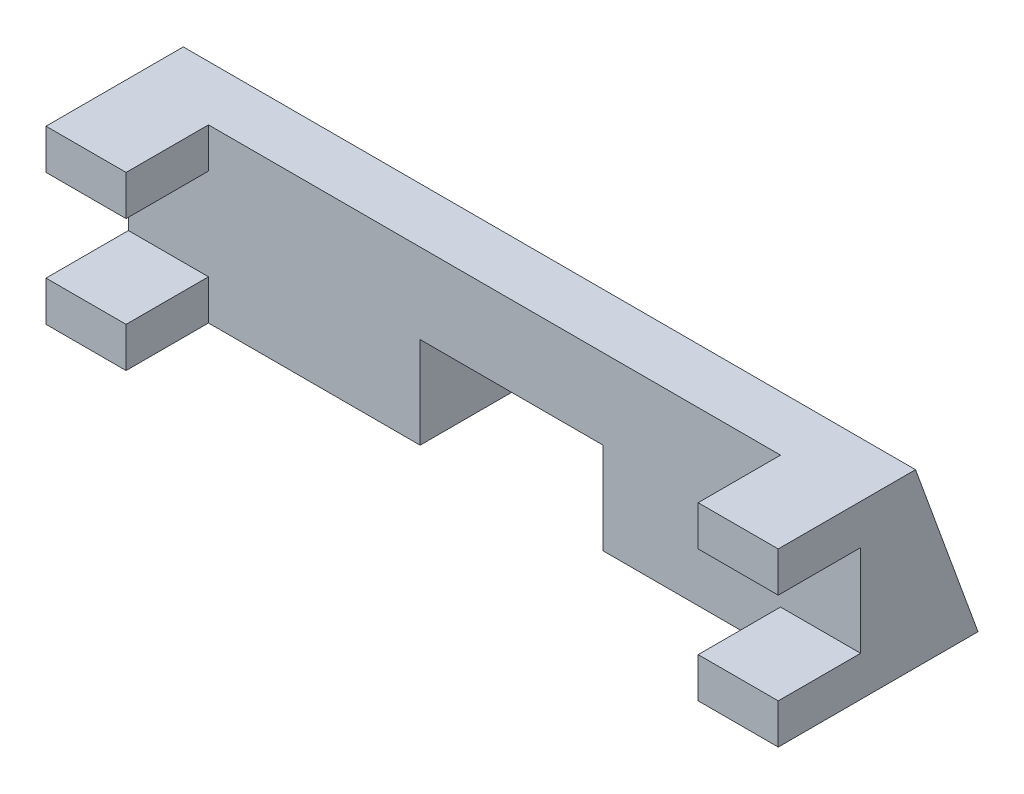
ISO-10303-21;
HEADER;
FILE_DESCRIPTION(('STEP AP214'),'2;1');
FILE_NAME('part.step','',(''),(''),'','','');
FILE_SCHEMA(('AUTOMOTIVE_DESIGN { 1 0 10303 214 1 1 1 1 }'));
ENDSEC;
DATA;
#1=APPLICATION_CONTEXT('core data for automotive mechanical design processes');
#2=APPLICATION_PROTOCOL_DEFINITION('international standard','automotive_design',2000,#1);
#3=PRODUCT_CONTEXT('',#1,'mechanical');
#4=PRODUCT('Part','Part','',(#3));
#5=PRODUCT_RELATED_PRODUCT_CATEGORY('part','',(#4));
#6=PRODUCT_DEFINITION_FORMATION('','',#4);
#7=PRODUCT_DEFINITION_CONTEXT('part definition',#1,'design');
#8=PRODUCT_DEFINITION('design','',#6,#7);
#9=PRODUCT_DEFINITION_SHAPE('','',#8);
#10=(LENGTH_UNIT() NAMED_UNIT(*) SI_UNIT(.MILLI.,.METRE.));
#11=(NAMED_UNIT(*) PLANE_ANGLE_UNIT() SI_UNIT($,.RADIAN.));
#12=(NAMED_UNIT(*) SI_UNIT($,.STERADIAN.) SOLID_ANGLE_UNIT());
#13=UNCERTAINTY_MEASURE_WITH_UNIT(LENGTH_MEASURE(1.E-05),#10,'distance_accuracy_value','');
#14=(GEOMETRIC_REPRESENTATION_CONTEXT(3) GLOBAL_UNCERTAINTY_ASSIGNED_CONTEXT((#13)) GLOBAL_UNIT_ASSIGNED_CONTEXT((#10,
#11,#12)) REPRESENTATION_CONTEXT('',''));
#15=CARTESIAN_POINT('',(0.,0.,0.));
#16=DIRECTION('',(0.,0.,1.));
#17=DIRECTION('',(1.,0.,0.));
#18=AXIS2_PLACEMENT_3D('',#15,#16,#17);
#19=CARTESIAN_POINT('',(64.,-14.8171344824525,-12.3591769522449));
#20=DIRECTION('',(0.,1.,0.));
#21=DIRECTION('',(0.,0.,1.));
#22=AXIS2_PLACEMENT_3D('',#19,#20,#21);
#23=PLANE('',#22);
#24=DIRECTION('',(-1.,0.,0.));
#25=VECTOR('',#24,1.);
#26=CARTESIAN_POINT('',(64.,-14.8171344824525,-17.8187304662379));
#27=LINE('',#26,#25);
#28=CARTESIAN_POINT('',(25.5,-14.8171344824525,-17.8187304662379));
#29=VERTEX_POINT('',#28);
#30=CARTESIAN_POINT('',(0.,-14.8171344824525,-17.8187304662379));
#31=VERTEX_POINT('',#30);
#32=EDGE_CURVE('E187',#29,#31,#27,.T.);
#33=ORIENTED_EDGE('',*,*,#32,.F.);
#34=DIRECTION('',(0.,0.,1.));
#35=VECTOR('',#34,1.);
#36=CARTESIAN_POINT('',(25.5,-14.8171344824525,-12.3591769522449));
#37=LINE('',#36,#35);
#38=CARTESIAN_POINT('',(25.5,-14.8171344824525,-7.55917695224487));
#39=VERTEX_POINT('',#38);
#40=EDGE_CURVE('E11',#29,#39,#37,.T.);
#41=ORIENTED_EDGE('',*,*,#40,.T.);
#42=DIRECTION('',(-1.,0.,0.));
#43=VECTOR('',#42,1.);
#44=CARTESIAN_POINT('',(7.,-14.8171344824525,-7.55917695224487));
#45=LINE('',#44,#43);
#46=CARTESIAN_POINT('',(7.,-14.8171344824525,-7.55917695224487));
#47=VERTEX_POINT('',#46);
#48=EDGE_CURVE('E184',#39,#47,#45,.T.);
#49=ORIENTED_EDGE('',*,*,#48,.T.);
#50=DIRECTION('',(0.,0.,1.));
#51=VECTOR('',#50,1.);
#52=CARTESIAN_POINT('',(7.,-14.8171344824525,-7.55917695224487));
#53=LINE('',#52,#51);
#54=CARTESIAN_POINT('',(7.,-14.8171344824525,-0.359176952244866));
#55=VERTEX_POINT('',#54);
#56=EDGE_CURVE('E198',#47,#55,#53,.T.);
#57=ORIENTED_EDGE('',*,*,#56,.T.);
#58=DIRECTION('',(-1.,0.,0.));
#59=VECTOR('',#58,1.);
#60=CARTESIAN_POINT('',(64.,-14.8171344824525,-0.359176952244866));
#61=LINE('',#60,#59);
#62=CARTESIAN_POINT('',(0.,-14.8171344824525,-0.359176952244866));
#63=VERTEX_POINT('',#62);
#64=EDGE_CURVE('E244',#55,#63,#61,.T.);
#65=ORIENTED_EDGE('',*,*,#64,.T.);
#66=DIRECTION('',(0.,0.,-1.));
#67=VECTOR('',#66,1.);
#68=CARTESIAN_POINT('',(0.,-14.8171344824525,-12.3591769522449));
#69=LINE('',#68,#67);
#70=EDGE_CURVE('E229',#63,#31,#69,.T.);
#71=ORIENTED_EDGE('',*,*,#70,.T.);
#72=EDGE_LOOP('',(#33,#41,#49,#57,#65,#71));
#73=FACE_BOUND('',#72,.T.);
#74=ADVANCED_FACE('F33',(#73),#23,.F.);
#75=CARTESIAN_POINT('',(64.,-3.31713448245253,-0.359176952244866));
#76=DIRECTION('',(0.,0.,-1.));
#77=DIRECTION('',(-1.,0.,0.));
#78=AXIS2_PLACEMENT_3D('',#75,#76,#77);
#79=PLANE('',#78);
#80=DIRECTION('',(-1.,0.,0.));
#81=VECTOR('',#80,1.);
#82=CARTESIAN_POINT('',(64.,-3.31713448245253,-0.359176952244866));
#83=LINE('',#82,#81);
#84=CARTESIAN_POINT('',(7.,-3.31713448245253,-0.359176952244866));
#85=VERTEX_POINT('',#84);
#86=CARTESIAN_POINT('',(0.,-3.31713448245253,-0.359176952244866));
#87=VERTEX_POINT('',#86);
#88=EDGE_CURVE('E280',#85,#87,#83,.T.);
#89=ORIENTED_EDGE('',*,*,#88,.F.);
#90=DIRECTION('',(0.,1.,0.));
#91=VECTOR('',#90,1.);
#92=CARTESIAN_POINT('',(7.,-14.8171344824525,-0.359176952244866));
#93=LINE('',#92,#91);
#94=CARTESIAN_POINT('',(7.,0.182865517547473,-0.359176952244866));
#95=VERTEX_POINT('',#94);
#96=EDGE_CURVE('E196',#85,#95,#93,.T.);
#97=ORIENTED_EDGE('',*,*,#96,.T.);
#98=DIRECTION('',(-1.,0.,0.));
#99=VECTOR('',#98,1.);
#100=CARTESIAN_POINT('',(64.,0.182865517547472,-0.359176952244866));
#101=LINE('',#100,#99);
#102=CARTESIAN_POINT('',(0.,0.182865517547472,-0.359176952244866));
#103=VERTEX_POINT('',#102);
#104=EDGE_CURVE('E284',#95,#103,#101,.T.);
#105=ORIENTED_EDGE('',*,*,#104,.T.);
#106=DIRECTION('',(0.,-1.,0.));
#107=VECTOR('',#106,1.);
#108=CARTESIAN_POINT('',(0.,-3.31713448245253,-0.359176952244866));
#109=LINE('',#108,#107);
#110=EDGE_CURVE('E249',#103,#87,#109,.T.);
#111=ORIENTED_EDGE('',*,*,#110,.T.);
#112=EDGE_LOOP('',(#89,#97,#105,#111));
#113=FACE_BOUND('',#112,.T.);
#114=ADVANCED_FACE('F372',(#113),#79,.F.);
#115=CARTESIAN_POINT('',(64.,-3.31713448245253,-0.359176952244866));
#116=DIRECTION('',(0.,1.,0.));
#117=DIRECTION('',(0.,0.,1.));
#118=AXIS2_PLACEMENT_3D('',#115,#116,#117);
#119=PLANE('',#118);
#120=DIRECTION('',(-1.,0.,0.));
#121=VECTOR('',#120,1.);
#122=CARTESIAN_POINT('',(64.,-3.31713448245253,-7.55917695224487));
#123=LINE('',#122,#121);
#124=CARTESIAN_POINT('',(7.,-3.31713448245253,-7.55917695224487));
#125=VERTEX_POINT('',#124);
#126=CARTESIAN_POINT('',(0.,-3.31713448245253,-7.55917695224487));
#127=VERTEX_POINT('',#126);
#128=EDGE_CURVE('E276',#125,#127,#123,.T.);
#129=ORIENTED_EDGE('',*,*,#128,.F.);
#130=DIRECTION('',(0.,0.,1.));
#131=VECTOR('',#130,1.);
#132=CARTESIAN_POINT('',(7.,-3.31713448245253,-0.359176952244866));
#133=LINE('',#132,#131);
#134=EDGE_CURVE('E221',#125,#85,#133,.T.);
#135=ORIENTED_EDGE('',*,*,#134,.T.);
#136=ORIENTED_EDGE('',*,*,#88,.T.);
#137=DIRECTION('',(0.,0.,-1.));
#138=VECTOR('',#137,1.);
#139=CARTESIAN_POINT('',(0.,-3.31713448245253,-0.359176952244866));
#140=LINE('',#139,#138);
#141=EDGE_CURVE('E252',#87,#127,#140,.T.);
#142=ORIENTED_EDGE('',*,*,#141,.T.);
#143=EDGE_LOOP('',(#129,#135,#136,#142));
#144=FACE_BOUND('',#143,.T.);
#145=ADVANCED_FACE('F376',(#144),#119,.F.);
#146=CARTESIAN_POINT('',(64.,-11.3171344824525,-0.359176952244866));
#147=DIRECTION('',(0.,-1.,0.));
#148=DIRECTION('',(0.,0.,-1.));
#149=AXIS2_PLACEMENT_3D('',#146,#147,#148);
#150=PLANE('',#149);
#151=DIRECTION('',(-1.,0.,0.));
#152=VECTOR('',#151,1.);
#153=CARTESIAN_POINT('',(64.,-11.3171344824525,-0.359176952244866));
#154=LINE('',#153,#152);
#155=CARTESIAN_POINT('',(7.,-11.3171344824525,-0.359176952244866));
#156=VERTEX_POINT('',#155);
#157=CARTESIAN_POINT('',(0.,-11.3171344824525,-0.359176952244866));
#158=VERTEX_POINT('',#157);
#159=EDGE_CURVE('E268',#156,#158,#154,.T.);
#160=ORIENTED_EDGE('',*,*,#159,.F.);
#161=DIRECTION('',(0.,0.,-1.));
#162=VECTOR('',#161,1.);
#163=CARTESIAN_POINT('',(7.,-11.3171344824525,-0.359176952244866));
#164=LINE('',#163,#162);
#165=CARTESIAN_POINT('',(7.,-11.3171344824525,-7.55917695224487));
#166=VERTEX_POINT('',#165);
#167=EDGE_CURVE('E218',#156,#166,#164,.T.);
#168=ORIENTED_EDGE('',*,*,#167,.T.);
#169=DIRECTION('',(-1.,0.,0.));
#170=VECTOR('',#169,1.);
#171=CARTESIAN_POINT('',(64.,-11.3171344824525,-7.55917695224487));
#172=LINE('',#171,#170);
#173=CARTESIAN_POINT('',(0.,-11.3171344824525,-7.55917695224487));
#174=VERTEX_POINT('',#173);
#175=EDGE_CURVE('E272',#166,#174,#172,.T.);
#176=ORIENTED_EDGE('',*,*,#175,.T.);
#177=DIRECTION('',(0.,0.,1.));
#178=VECTOR('',#177,1.);
#179=CARTESIAN_POINT('',(0.,-11.3171344824525,-0.359176952244866));
#180=LINE('',#179,#178);
#181=EDGE_CURVE('E258',#174,#158,#180,.T.);
#182=ORIENTED_EDGE('',*,*,#181,.T.);
#183=EDGE_LOOP('',(#160,#168,#176,#182));
#184=FACE_BOUND('',#183,.T.);
#185=ADVANCED_FACE('F379',(#184),#150,.F.);
#186=CARTESIAN_POINT('',(64.,-14.8171344824525,-0.359176952244866));
#187=DIRECTION('',(0.,0.,-1.));
#188=DIRECTION('',(-1.,0.,0.));
#189=AXIS2_PLACEMENT_3D('',#186,#187,#188);
#190=PLANE('',#189);
#191=ORIENTED_EDGE('',*,*,#64,.F.);
#192=EDGE_CURVE('E211',#55,#156,#93,.T.);
#193=ORIENTED_EDGE('',*,*,#192,.T.);
#194=ORIENTED_EDGE('',*,*,#159,.T.);
#195=DIRECTION('',(0.,-1.,0.));
#196=VECTOR('',#195,1.);
#197=CARTESIAN_POINT('',(0.,-14.8171344824525,-0.359176952244866));
#198=LINE('',#197,#196);
#199=EDGE_CURVE('E261',#158,#63,#198,.T.);
#200=ORIENTED_EDGE('',*,*,#199,.T.);
#201=EDGE_LOOP('',(#191,#193,#194,#200));
#202=FACE_BOUND('',#201,.T.);
#203=ADVANCED_FACE('F339',(#202),#190,.F.);
#204=CARTESIAN_POINT('',(64.,0.182865517547472,-12.3591769522449));
#205=DIRECTION('',(0.,-0.342020143325666,0.939692620785909));
#206=DIRECTION('',(0.,-0.939692620785909,-0.342020143325666));
#207=AXIS2_PLACEMENT_3D('',#204,#205,#206);
#208=PLANE('',#207);
#209=DIRECTION('',(-1.,0.,0.));
#210=VECTOR('',#209,1.);
#211=CARTESIAN_POINT('',(64.,-6.81713448245253,-14.9069685921083));
#212=LINE('',#211,#210);
#213=CARTESIAN_POINT('',(41.5,-6.81713448245253,-14.9069685921083));
#214=VERTEX_POINT('',#213);
#215=CARTESIAN_POINT('',(25.5,-6.81713448245253,-14.9069685921083));
#216=VERTEX_POINT('',#215);
#217=EDGE_CURVE('E328',#214,#216,#212,.T.);
#218=ORIENTED_EDGE('',*,*,#217,.T.);
#219=DIRECTION('',(0.,-0.939692620785909,-0.342020143325666));
#220=VECTOR('',#219,1.);
#221=CARTESIAN_POINT('',(25.5,0.182865517547472,-12.3591769522449));
#222=LINE('',#221,#220);
#223=EDGE_CURVE('E326',#216,#29,#222,.T.);
#224=ORIENTED_EDGE('',*,*,#223,.T.);
#225=ORIENTED_EDGE('',*,*,#32,.T.);
#226=DIRECTION('',(0.,0.939692620785909,0.342020143325666));
#227=VECTOR('',#226,1.);
#228=CARTESIAN_POINT('',(0.,0.182865517547472,-12.3591769522449));
#229=LINE('',#228,#227);
#230=CARTESIAN_POINT('',(0.,0.182865517547472,-12.3591769522449));
#231=VERTEX_POINT('',#230);
#232=EDGE_CURVE('E224',#31,#231,#229,.T.);
#233=ORIENTED_EDGE('',*,*,#232,.T.);
#234=DIRECTION('',(-1.,0.,0.));
#235=VECTOR('',#234,1.);
#236=CARTESIAN_POINT('',(64.,0.182865517547472,-12.3591769522449));
#237=LINE('',#236,#235);
#238=CARTESIAN_POINT('',(64.,0.182865517547472,-12.3591769522449));
#239=VERTEX_POINT('',#238);
#240=EDGE_CURVE('E288',#239,#231,#237,.T.);
#241=ORIENTED_EDGE('',*,*,#240,.F.);
#242=DIRECTION('',(0.,0.939692620785909,0.342020143325666));
#243=VECTOR('',#242,1.);
#244=CARTESIAN_POINT('',(64.,0.182865517547472,-12.3591769522449));
#245=LINE('',#244,#243);
#246=CARTESIAN_POINT('',(64.,-14.8171344824525,-17.8187304662379));
#247=VERTEX_POINT('',#246);
#248=EDGE_CURVE('E228',#247,#239,#245,.T.);
#249=ORIENTED_EDGE('',*,*,#248,.F.);
#250=CARTESIAN_POINT('',(41.5,-14.8171344824525,-17.8187304662379));
#251=VERTEX_POINT('',#250);
#252=EDGE_CURVE('E291',#247,#251,#27,.T.);
#253=ORIENTED_EDGE('',*,*,#252,.T.);
#254=DIRECTION('',(0.,0.939692620785909,0.342020143325666));
#255=VECTOR('',#254,1.);
#256=CARTESIAN_POINT('',(41.5,0.182865517547472,-12.3591769522449));
#257=LINE('',#256,#255);
#258=EDGE_CURVE('E48',#251,#214,#257,.T.);
#259=ORIENTED_EDGE('',*,*,#258,.T.);
#260=EDGE_LOOP('',(#218,#224,#225,#233,#241,#249,#253,#259));
#261=FACE_BOUND('',#260,.T.);
#262=ADVANCED_FACE('F35',(#261),#208,.F.);
#263=CARTESIAN_POINT('',(64.,0.182865517547472,-12.3591769522449));
#264=DIRECTION('',(0.,-1.,0.));
#265=DIRECTION('',(0.,0.,-1.));
#266=AXIS2_PLACEMENT_3D('',#263,#264,#265);
#267=PLANE('',#266);
#268=ORIENTED_EDGE('',*,*,#104,.F.);
#269=DIRECTION('',(0.,0.,1.));
#270=VECTOR('',#269,1.);
#271=CARTESIAN_POINT('',(7.,0.182865517547473,-7.55917695224487));
#272=LINE('',#271,#270);
#273=CARTESIAN_POINT('',(7.,0.182865517547473,-7.55917695224487));
#274=VERTEX_POINT('',#273);
#275=EDGE_CURVE('E330',#274,#95,#272,.T.);
#276=ORIENTED_EDGE('',*,*,#275,.F.);
#277=DIRECTION('',(-1.,0.,0.));
#278=VECTOR('',#277,1.);
#279=CARTESIAN_POINT('',(7.,0.182865517547473,-7.55917695224487));
#280=LINE('',#279,#278);
#281=CARTESIAN_POINT('',(57.,0.182865517547473,-7.55917695224487));
#282=VERTEX_POINT('',#281);
#283=EDGE_CURVE('E334',#282,#274,#280,.T.);
#284=ORIENTED_EDGE('',*,*,#283,.F.);
#285=DIRECTION('',(0.,0.,-1.));
#286=VECTOR('',#285,1.);
#287=CARTESIAN_POINT('',(57.,0.182865517547473,-7.55917695224487));
#288=LINE('',#287,#286);
#289=CARTESIAN_POINT('',(57.,0.182865517547473,-0.359176952244866));
#290=VERTEX_POINT('',#289);
#291=EDGE_CURVE('E332',#290,#282,#288,.T.);
#292=ORIENTED_EDGE('',*,*,#291,.F.);
#293=CARTESIAN_POINT('',(64.,0.182865517547472,-0.359176952244866));
#294=VERTEX_POINT('',#293);
#295=EDGE_CURVE('E285',#294,#290,#101,.T.);
#296=ORIENTED_EDGE('',*,*,#295,.F.);
#297=DIRECTION('',(0.,0.,1.));
#298=VECTOR('',#297,1.);
#299=CARTESIAN_POINT('',(64.,0.182865517547472,-12.3591769522449));
#300=LINE('',#299,#298);
#301=EDGE_CURVE('E231',#239,#294,#300,.T.);
#302=ORIENTED_EDGE('',*,*,#301,.F.);
#303=ORIENTED_EDGE('',*,*,#240,.T.);
#304=DIRECTION('',(0.,0.,1.));
#305=VECTOR('',#304,1.);
#306=CARTESIAN_POINT('',(0.,0.182865517547472,-12.3591769522449));
#307=LINE('',#306,#305);
#308=EDGE_CURVE('E246',#231,#103,#307,.T.);
#309=ORIENTED_EDGE('',*,*,#308,.T.);
#310=EDGE_LOOP('',(#268,#276,#284,#292,#296,#302,#303,#309));
#311=FACE_BOUND('',#310,.T.);
#312=ADVANCED_FACE('F351',(#311),#267,.F.);
#313=ORIENTED_EDGE('',*,*,#295,.T.);
#314=DIRECTION('',(0.,1.,0.));
#315=VECTOR('',#314,1.);
#316=CARTESIAN_POINT('',(57.,-14.8171344824525,-0.359176952244866));
#317=LINE('',#316,#315);
#318=CARTESIAN_POINT('',(57.,-3.31713448245253,-0.359176952244866));
#319=VERTEX_POINT('',#318);
#320=EDGE_CURVE('E210',#319,#290,#317,.T.);
#321=ORIENTED_EDGE('',*,*,#320,.F.);
#322=CARTESIAN_POINT('',(64.,-3.31713448245253,-0.359176952244866));
#323=VERTEX_POINT('',#322);
#324=EDGE_CURVE('E281',#323,#319,#83,.T.);
#325=ORIENTED_EDGE('',*,*,#324,.F.);
#326=DIRECTION('',(0.,-1.,0.));
#327=VECTOR('',#326,1.);
#328=CARTESIAN_POINT('',(64.,-3.31713448245253,-0.359176952244866));
#329=LINE('',#328,#327);
#330=EDGE_CURVE('E233',#294,#323,#329,.T.);
#331=ORIENTED_EDGE('',*,*,#330,.F.);
#332=EDGE_LOOP('',(#313,#321,#325,#331));
#333=FACE_BOUND('',#332,.T.);
#334=ADVANCED_FACE('F360',(#333),#79,.F.);
#335=ORIENTED_EDGE('',*,*,#324,.T.);
#336=DIRECTION('',(0.,0.,-1.));
#337=VECTOR('',#336,1.);
#338=CARTESIAN_POINT('',(57.,-3.31713448245253,-0.359176952244866));
#339=LINE('',#338,#337);
#340=CARTESIAN_POINT('',(57.,-3.31713448245253,-7.55917695224487));
#341=VERTEX_POINT('',#340);
#342=EDGE_CURVE('E216',#319,#341,#339,.T.);
#343=ORIENTED_EDGE('',*,*,#342,.T.);
#344=CARTESIAN_POINT('',(64.,-3.31713448245253,-7.55917695224487));
#345=VERTEX_POINT('',#344);
#346=EDGE_CURVE('E277',#345,#341,#123,.T.);
#347=ORIENTED_EDGE('',*,*,#346,.F.);
#348=DIRECTION('',(0.,0.,-1.));
#349=VECTOR('',#348,1.);
#350=CARTESIAN_POINT('',(64.,-3.31713448245253,-0.359176952244866));
#351=LINE('',#350,#349);
#352=EDGE_CURVE('E235',#323,#345,#351,.T.);
#353=ORIENTED_EDGE('',*,*,#352,.F.);
#354=EDGE_LOOP('',(#335,#343,#347,#353));
#355=FACE_BOUND('',#354,.T.);
#356=ADVANCED_FACE('F362',(#355),#119,.F.);
#357=CARTESIAN_POINT('',(64.,-11.3171344824525,-7.55917695224487));
#358=DIRECTION('',(0.,0.,-1.));
#359=DIRECTION('',(-1.,0.,0.));
#360=AXIS2_PLACEMENT_3D('',#357,#358,#359);
#361=PLANE('',#360);
#362=ORIENTED_EDGE('',*,*,#48,.F.);
#363=DIRECTION('',(0.,-1.,0.));
#364=VECTOR('',#363,1.);
#365=CARTESIAN_POINT('',(25.5,-6.81713448245253,-7.55917695224487));
#366=LINE('',#365,#364);
#367=CARTESIAN_POINT('',(25.5,-6.81713448245253,-7.55917695224487));
#368=VERTEX_POINT('',#367);
#369=EDGE_CURVE('E170',#368,#39,#366,.T.);
#370=ORIENTED_EDGE('',*,*,#369,.F.);
#371=DIRECTION('',(-1.,0.,0.));
#372=VECTOR('',#371,1.);
#373=CARTESIAN_POINT('',(25.5,-6.81713448245253,-7.55917695224487));
#374=LINE('',#373,#372);
#375=CARTESIAN_POINT('',(41.5,-6.81713448245253,-7.55917695224487));
#376=VERTEX_POINT('',#375);
#377=EDGE_CURVE('E318',#376,#368,#374,.T.);
#378=ORIENTED_EDGE('',*,*,#377,.F.);
#379=DIRECTION('',(0.,1.,0.));
#380=VECTOR('',#379,1.);
#381=CARTESIAN_POINT('',(41.5,-6.81713448245253,-7.55917695224487));
#382=LINE('',#381,#380);
#383=CARTESIAN_POINT('',(41.5,-14.8171344824525,-7.55917695224487));
#384=VERTEX_POINT('',#383);
#385=EDGE_CURVE('E179',#384,#376,#382,.T.);
#386=ORIENTED_EDGE('',*,*,#385,.F.);
#387=CARTESIAN_POINT('',(57.,-14.8171344824525,-7.55917695224487));
#388=VERTEX_POINT('',#387);
#389=EDGE_CURVE('E192',#388,#384,#45,.T.);
#390=ORIENTED_EDGE('',*,*,#389,.F.);
#391=DIRECTION('',(0.,1.,0.));
#392=VECTOR('',#391,1.);
#393=CARTESIAN_POINT('',(57.,-14.8171344824525,-7.55917695224487));
#394=LINE('',#393,#392);
#395=CARTESIAN_POINT('',(57.,-11.3171344824525,-7.55917695224487));
#396=VERTEX_POINT('',#395);
#397=EDGE_CURVE('E205',#388,#396,#394,.T.);
#398=ORIENTED_EDGE('',*,*,#397,.T.);
#399=CARTESIAN_POINT('',(64.,-11.3171344824525,-7.55917695224487));
#400=VERTEX_POINT('',#399);
#401=EDGE_CURVE('E273',#400,#396,#172,.T.);
#402=ORIENTED_EDGE('',*,*,#401,.F.);
#403=DIRECTION('',(0.,-1.,0.));
#404=VECTOR('',#403,1.);
#405=CARTESIAN_POINT('',(64.,-11.3171344824525,-7.55917695224487));
#406=LINE('',#405,#404);
#407=EDGE_CURVE('E237',#345,#400,#406,.T.);
#408=ORIENTED_EDGE('',*,*,#407,.F.);
#409=ORIENTED_EDGE('',*,*,#346,.T.);
#410=EDGE_CURVE('E56',#341,#282,#394,.T.);
#411=ORIENTED_EDGE('',*,*,#410,.T.);
#412=ORIENTED_EDGE('',*,*,#283,.T.);
#413=DIRECTION('',(0.,1.,0.));
#414=VECTOR('',#413,1.);
#415=CARTESIAN_POINT('',(7.,-14.8171344824525,-7.55917695224487));
#416=LINE('',#415,#414);
#417=EDGE_CURVE('E204',#125,#274,#416,.T.);
#418=ORIENTED_EDGE('',*,*,#417,.F.);
#419=ORIENTED_EDGE('',*,*,#128,.T.);
#420=DIRECTION('',(0.,-1.,0.));
#421=VECTOR('',#420,1.);
#422=CARTESIAN_POINT('',(0.,-11.3171344824525,-7.55917695224487));
#423=LINE('',#422,#421);
#424=EDGE_CURVE('E255',#127,#174,#423,.T.);
#425=ORIENTED_EDGE('',*,*,#424,.T.);
#426=ORIENTED_EDGE('',*,*,#175,.F.);
#427=EDGE_CURVE('E190',#47,#166,#416,.T.);
#428=ORIENTED_EDGE('',*,*,#427,.F.);
#429=EDGE_LOOP('',(#362,#370,#378,#386,#390,#398,#402,#408,#409,#411,#412,#418,#419,#425,#426,#428));
#430=FACE_BOUND('',#429,.T.);
#431=ADVANCED_FACE('F188',(#430),#361,.F.);
#432=ORIENTED_EDGE('',*,*,#401,.T.);
#433=DIRECTION('',(0.,0.,1.));
#434=VECTOR('',#433,1.);
#435=CARTESIAN_POINT('',(57.,-11.3171344824525,-0.359176952244866));
#436=LINE('',#435,#434);
#437=CARTESIAN_POINT('',(57.,-11.3171344824525,-0.359176952244866));
#438=VERTEX_POINT('',#437);
#439=EDGE_CURVE('E203',#396,#438,#436,.T.);
#440=ORIENTED_EDGE('',*,*,#439,.T.);
#441=CARTESIAN_POINT('',(64.,-11.3171344824525,-0.359176952244866));
#442=VERTEX_POINT('',#441);
#443=EDGE_CURVE('E269',#442,#438,#154,.T.);
#444=ORIENTED_EDGE('',*,*,#443,.F.);
#445=DIRECTION('',(0.,0.,1.));
#446=VECTOR('',#445,1.);
#447=CARTESIAN_POINT('',(64.,-11.3171344824525,-0.359176952244866));
#448=LINE('',#447,#446);
#449=EDGE_CURVE('E239',#400,#442,#448,.T.);
#450=ORIENTED_EDGE('',*,*,#449,.F.);
#451=EDGE_LOOP('',(#432,#440,#444,#450));
#452=FACE_BOUND('',#451,.T.);
#453=ADVANCED_FACE('F314',(#452),#150,.F.);
#454=ORIENTED_EDGE('',*,*,#443,.T.);
#455=CARTESIAN_POINT('',(57.,-14.8171344824525,-0.359176952244866));
#456=VERTEX_POINT('',#455);
#457=EDGE_CURVE('E208',#456,#438,#317,.T.);
#458=ORIENTED_EDGE('',*,*,#457,.F.);
#459=CARTESIAN_POINT('',(64.,-14.8171344824525,-0.359176952244866));
#460=VERTEX_POINT('',#459);
#461=EDGE_CURVE('E265',#460,#456,#61,.T.);
#462=ORIENTED_EDGE('',*,*,#461,.F.);
#463=DIRECTION('',(0.,-1.,0.));
#464=VECTOR('',#463,1.);
#465=CARTESIAN_POINT('',(64.,-14.8171344824525,-0.359176952244866));
#466=LINE('',#465,#464);
#467=EDGE_CURVE('E241',#442,#460,#466,.T.);
#468=ORIENTED_EDGE('',*,*,#467,.F.);
#469=EDGE_LOOP('',(#454,#458,#462,#468));
#470=FACE_BOUND('',#469,.T.);
#471=ADVANCED_FACE('F308',(#470),#190,.F.);
#472=ORIENTED_EDGE('',*,*,#389,.T.);
#473=DIRECTION('',(0.,0.,-1.));
#474=VECTOR('',#473,1.);
#475=CARTESIAN_POINT('',(41.5,-14.8171344824525,-12.3591769522449));
#476=LINE('',#475,#474);
#477=EDGE_CURVE('E41',#384,#251,#476,.T.);
#478=ORIENTED_EDGE('',*,*,#477,.T.);
#479=ORIENTED_EDGE('',*,*,#252,.F.);
#480=DIRECTION('',(0.,0.,-1.));
#481=VECTOR('',#480,1.);
#482=CARTESIAN_POINT('',(64.,-14.8171344824525,-17.8187304662379));
#483=LINE('',#482,#481);
#484=EDGE_CURVE('E225',#460,#247,#483,.T.);
#485=ORIENTED_EDGE('',*,*,#484,.F.);
#486=ORIENTED_EDGE('',*,*,#461,.T.);
#487=DIRECTION('',(0.,0.,-1.));
#488=VECTOR('',#487,1.);
#489=CARTESIAN_POINT('',(57.,-14.8171344824525,-7.55917695224487));
#490=LINE('',#489,#488);
#491=EDGE_CURVE('E193',#456,#388,#490,.T.);
#492=ORIENTED_EDGE('',*,*,#491,.T.);
#493=EDGE_LOOP('',(#472,#478,#479,#485,#486,#492));
#494=FACE_BOUND('',#493,.T.);
#495=ADVANCED_FACE('F295',(#494),#23,.F.);
#496=CARTESIAN_POINT('',(64.,0.,0.));
#497=DIRECTION('',(-1.,0.,0.));
#498=DIRECTION('',(0.,0.,1.));
#499=AXIS2_PLACEMENT_3D('',#496,#497,#498);
#500=PLANE('',#499);
#501=ORIENTED_EDGE('',*,*,#484,.T.);
#502=ORIENTED_EDGE('',*,*,#248,.T.);
#503=ORIENTED_EDGE('',*,*,#301,.T.);
#504=ORIENTED_EDGE('',*,*,#330,.T.);
#505=ORIENTED_EDGE('',*,*,#352,.T.);
#506=ORIENTED_EDGE('',*,*,#407,.T.);
#507=ORIENTED_EDGE('',*,*,#449,.T.);
#508=ORIENTED_EDGE('',*,*,#467,.T.);
#509=EDGE_LOOP('',(#501,#502,#503,#504,#505,#506,#507,#508));
#510=FACE_BOUND('',#509,.T.);
#511=ADVANCED_FACE('F303',(#510),#500,.F.);
#512=CARTESIAN_POINT('',(0.,0.,0.));
#513=DIRECTION('',(-1.,0.,0.));
#514=DIRECTION('',(0.,0.,1.));
#515=AXIS2_PLACEMENT_3D('',#512,#513,#514);
#516=PLANE('',#515);
#517=ORIENTED_EDGE('',*,*,#232,.F.);
#518=ORIENTED_EDGE('',*,*,#70,.F.);
#519=ORIENTED_EDGE('',*,*,#199,.F.);
#520=ORIENTED_EDGE('',*,*,#181,.F.);
#521=ORIENTED_EDGE('',*,*,#424,.F.);
#522=ORIENTED_EDGE('',*,*,#141,.F.);
#523=ORIENTED_EDGE('',*,*,#110,.F.);
#524=ORIENTED_EDGE('',*,*,#308,.F.);
#525=EDGE_LOOP('',(#517,#518,#519,#520,#521,#522,#523,#524));
#526=FACE_BOUND('',#525,.T.);
#527=ADVANCED_FACE('F346',(#526),#516,.T.);
#528=CARTESIAN_POINT('',(57.,-14.8171344824525,-7.55917695224487));
#529=DIRECTION('',(1.,0.,0.));
#530=DIRECTION('',(0.,0.,-1.));
#531=AXIS2_PLACEMENT_3D('',#528,#529,#530);
#532=PLANE('',#531);
#533=ORIENTED_EDGE('',*,*,#397,.F.);
#534=ORIENTED_EDGE('',*,*,#491,.F.);
#535=ORIENTED_EDGE('',*,*,#457,.T.);
#536=ORIENTED_EDGE('',*,*,#439,.F.);
#537=EDGE_LOOP('',(#533,#534,#535,#536));
#538=FACE_BOUND('',#537,.T.);
#539=ADVANCED_FACE('F312',(#538),#532,.F.);
#540=CARTESIAN_POINT('',(7.,-14.8171344824525,-7.55917695224487));
#541=DIRECTION('',(-1.,0.,0.));
#542=DIRECTION('',(0.,0.,1.));
#543=AXIS2_PLACEMENT_3D('',#540,#541,#542);
#544=PLANE('',#543);
#545=ORIENTED_EDGE('',*,*,#192,.F.);
#546=ORIENTED_EDGE('',*,*,#56,.F.);
#547=ORIENTED_EDGE('',*,*,#427,.T.);
#548=ORIENTED_EDGE('',*,*,#167,.F.);
#549=EDGE_LOOP('',(#545,#546,#547,#548));
#550=FACE_BOUND('',#549,.T.);
#551=ADVANCED_FACE('F380',(#550),#544,.F.);
#552=ORIENTED_EDGE('',*,*,#417,.T.);
#553=ORIENTED_EDGE('',*,*,#275,.T.);
#554=ORIENTED_EDGE('',*,*,#96,.F.);
#555=ORIENTED_EDGE('',*,*,#134,.F.);
#556=EDGE_LOOP('',(#552,#553,#554,#555));
#557=FACE_BOUND('',#556,.T.);
#558=ADVANCED_FACE('F369',(#557),#544,.F.);
#559=ORIENTED_EDGE('',*,*,#320,.T.);
#560=ORIENTED_EDGE('',*,*,#291,.T.);
#561=ORIENTED_EDGE('',*,*,#410,.F.);
#562=ORIENTED_EDGE('',*,*,#342,.F.);
#563=EDGE_LOOP('',(#559,#560,#561,#562));
#564=FACE_BOUND('',#563,.T.);
#565=ADVANCED_FACE('F366',(#564),#532,.F.);
#566=CARTESIAN_POINT('',(25.5,-6.81713448245253,-71.5591769522449));
#567=DIRECTION('',(0.,1.,0.));
#568=DIRECTION('',(0.,0.,1.));
#569=AXIS2_PLACEMENT_3D('',#566,#567,#568);
#570=PLANE('',#569);
#571=DIRECTION('',(0.,0.,1.));
#572=VECTOR('',#571,1.);
#573=CARTESIAN_POINT('',(41.5,-6.81713448245253,-71.5591769522449));
#574=LINE('',#573,#572);
#575=EDGE_CURVE('E320',#214,#376,#574,.T.);
#576=ORIENTED_EDGE('',*,*,#575,.T.);
#577=ORIENTED_EDGE('',*,*,#377,.T.);
#578=DIRECTION('',(0.,0.,1.));
#579=VECTOR('',#578,1.);
#580=CARTESIAN_POINT('',(25.5,-6.81713448245253,-71.5591769522449));
#581=LINE('',#580,#579);
#582=EDGE_CURVE('E174',#216,#368,#581,.T.);
#583=ORIENTED_EDGE('',*,*,#582,.F.);
#584=ORIENTED_EDGE('',*,*,#217,.F.);
#585=EDGE_LOOP('',(#576,#577,#583,#584));
#586=FACE_BOUND('',#585,.T.);
#587=ADVANCED_FACE('F471',(#586),#570,.F.);
#588=CARTESIAN_POINT('',(25.5,-6.81713448245253,-71.5591769522449));
#589=DIRECTION('',(-1.,0.,0.));
#590=DIRECTION('',(0.,0.,1.));
#591=AXIS2_PLACEMENT_3D('',#588,#589,#590);
#592=PLANE('',#591);
#593=ORIENTED_EDGE('',*,*,#582,.T.);
#594=ORIENTED_EDGE('',*,*,#369,.T.);
#595=ORIENTED_EDGE('',*,*,#40,.F.);
#596=ORIENTED_EDGE('',*,*,#223,.F.);
#597=EDGE_LOOP('',(#593,#594,#595,#596));
#598=FACE_BOUND('',#597,.T.);
#599=ADVANCED_FACE('F171',(#598),#592,.F.);
#600=CARTESIAN_POINT('',(41.5,-6.81713448245253,-71.5591769522449));
#601=DIRECTION('',(1.,0.,0.));
#602=DIRECTION('',(0.,0.,-1.));
#603=AXIS2_PLACEMENT_3D('',#600,#601,#602);
#604=PLANE('',#603);
#605=ORIENTED_EDGE('',*,*,#477,.F.);
#606=ORIENTED_EDGE('',*,*,#385,.T.);
#607=ORIENTED_EDGE('',*,*,#575,.F.);
#608=ORIENTED_EDGE('',*,*,#258,.F.);
#609=EDGE_LOOP('',(#605,#606,#607,#608));
#610=FACE_BOUND('',#609,.T.);
#611=ADVANCED_FACE('F542',(#610),#604,.F.);
#612=CLOSED_SHELL('',(#74,#114,#145,#185,#203,#262,#312,#334,#356,#431,#453,#471,#495,#511,#527,
#539,#551,#558,#565,#587,#599,#611));
#613=MANIFOLD_SOLID_BREP('B2',#612);
#614=ADVANCED_BREP_SHAPE_REPRESENTATION('',(#18,#613),#14);
#615=SHAPE_DEFINITION_REPRESENTATION(#9,#614);
ENDSEC;
END-ISO-10303-21;
